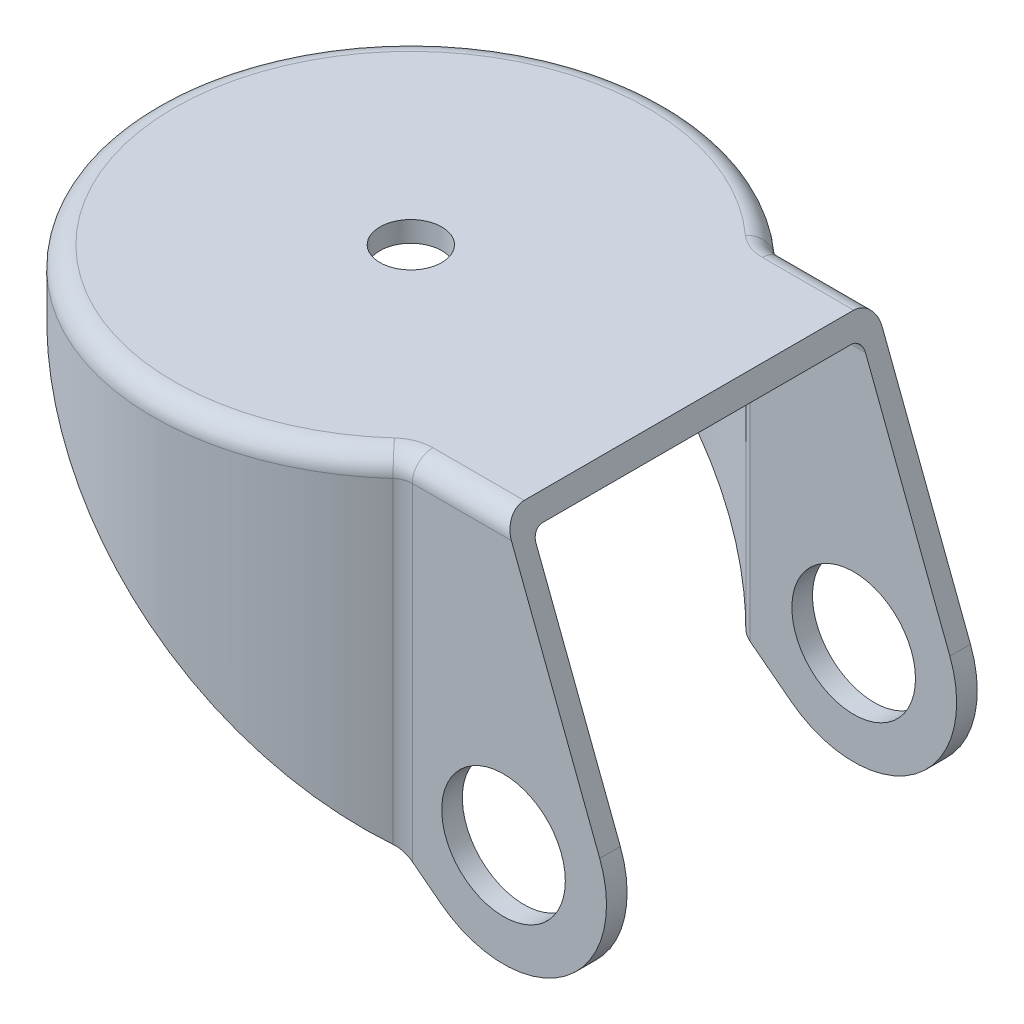
ISO-10303-21;
HEADER;
FILE_DESCRIPTION(('STEP AP214'),'2;1');
FILE_NAME('part.step','',(''),(''),'','','');
FILE_SCHEMA(('AUTOMOTIVE_DESIGN { 1 0 10303 214 1 1 1 1 }'));
ENDSEC;
DATA;
#1=APPLICATION_CONTEXT('core data for automotive mechanical design processes');
#2=APPLICATION_PROTOCOL_DEFINITION('international standard','automotive_design',2000,#1);
#3=PRODUCT_CONTEXT('',#1,'mechanical');
#4=PRODUCT('Part','Part','',(#3));
#5=PRODUCT_RELATED_PRODUCT_CATEGORY('part','',(#4));
#6=PRODUCT_DEFINITION_FORMATION('','',#4);
#7=PRODUCT_DEFINITION_CONTEXT('part definition',#1,'design');
#8=PRODUCT_DEFINITION('design','',#6,#7);
#9=PRODUCT_DEFINITION_SHAPE('','',#8);
#10=(LENGTH_UNIT() NAMED_UNIT(*) SI_UNIT(.MILLI.,.METRE.));
#11=(NAMED_UNIT(*) PLANE_ANGLE_UNIT() SI_UNIT($,.RADIAN.));
#12=(NAMED_UNIT(*) SI_UNIT($,.STERADIAN.) SOLID_ANGLE_UNIT());
#13=UNCERTAINTY_MEASURE_WITH_UNIT(LENGTH_MEASURE(1.E-05),#10,'distance_accuracy_value','');
#14=(GEOMETRIC_REPRESENTATION_CONTEXT(3) GLOBAL_UNCERTAINTY_ASSIGNED_CONTEXT((#13)) GLOBAL_UNIT_ASSIGNED_CONTEXT((#10,
#11,#12)) REPRESENTATION_CONTEXT('',''));
#15=CARTESIAN_POINT('',(0.,0.,0.));
#16=DIRECTION('',(0.,0.,1.));
#17=DIRECTION('',(1.,0.,0.));
#18=AXIS2_PLACEMENT_3D('',#15,#16,#17);
#19=CARTESIAN_POINT('',(-13.5,-7.,0.));
#20=DIRECTION('',(0.,1.,0.));
#21=DIRECTION('',(0.,0.,1.));
#22=AXIS2_PLACEMENT_3D('',#19,#20,#21);
#23=CYLINDRICAL_SURFACE('',#22,11.5);
#24=CARTESIAN_POINT('',(-13.5,4.05655226766467,0.));
#25=DIRECTION('',(-0.608761429008722,-0.793353340291234,0.));
#26=DIRECTION('',(-0.793353340291234,0.608761429008722,0.));
#27=AXIS2_PLACEMENT_3D('',#24,#25,#26);
#28=ELLIPSE('',#27,14.4954327611181,11.5);
#29=CARTESIAN_POINT('',(-5.38240187582832,-2.17229985057966,-8.14583333333333));
#30=VERTEX_POINT('',#29);
#31=CARTESIAN_POINT('',(-23.8521026326173,12.,-5.00839006904988));
#32=VERTEX_POINT('',#31);
#33=EDGE_CURVE('E205',#30,#32,#28,.F.);
#34=ORIENTED_EDGE('',*,*,#33,.F.);
#35=DIRECTION('',(0.,1.,0.));
#36=VECTOR('',#35,1.);
#37=CARTESIAN_POINT('',(-5.38240187582832,-7.,-8.14583333333333));
#38=LINE('',#37,#36);
#39=CARTESIAN_POINT('',(-5.38240187582832,12.5,-8.14583333333333));
#40=VERTEX_POINT('',#39);
#41=EDGE_CURVE('E332',#30,#40,#38,.T.);
#42=ORIENTED_EDGE('',*,*,#41,.T.);
#43=CARTESIAN_POINT('',(-13.5,12.5,0.));
#44=DIRECTION('',(0.,-1.,0.));
#45=DIRECTION('',(0.,0.,-1.));
#46=AXIS2_PLACEMENT_3D('',#43,#44,#45);
#47=CIRCLE('',#46,11.5);
#48=CARTESIAN_POINT('',(-5.38240187582831,12.5,8.14583333333333));
#49=VERTEX_POINT('',#48);
#50=EDGE_CURVE('E328',#40,#49,#47,.F.);
#51=ORIENTED_EDGE('',*,*,#50,.T.);
#52=DIRECTION('',(0.,1.,0.));
#53=VECTOR('',#52,1.);
#54=CARTESIAN_POINT('',(-5.38240187582831,-7.,8.14583333333333));
#55=LINE('',#54,#53);
#56=CARTESIAN_POINT('',(-5.38240187582831,-2.17229985057967,8.14583333333333));
#57=VERTEX_POINT('',#56);
#58=EDGE_CURVE('E330',#49,#57,#55,.F.);
#59=ORIENTED_EDGE('',*,*,#58,.T.);
#60=CARTESIAN_POINT('',(-23.8521026326173,12.,5.00839006904989));
#61=VERTEX_POINT('',#60);
#62=EDGE_CURVE('E195',#61,#57,#28,.F.);
#63=ORIENTED_EDGE('',*,*,#62,.F.);
#64=CARTESIAN_POINT('',(-13.5,12.,0.));
#65=DIRECTION('',(0.,-1.,0.));
#66=DIRECTION('',(1.,0.,0.));
#67=AXIS2_PLACEMENT_3D('',#64,#65,#66);
#68=CIRCLE('',#67,11.5);
#69=EDGE_CURVE('E204',#32,#61,#68,.F.);
#70=ORIENTED_EDGE('',*,*,#69,.F.);
#71=EDGE_LOOP('',(#34,#42,#51,#59,#63,#70));
#72=FACE_BOUND('',#71,.T.);
#73=ADVANCED_FACE('F32',(#72),#23,.F.);
#74=CARTESIAN_POINT('',(-3.04380714504358,-3.96676670145619,-9.));
#75=DIRECTION('',(0.608761429008717,0.793353340291238,0.));
#76=DIRECTION('',(-0.793353340291238,0.608761429008717,0.));
#77=AXIS2_PLACEMENT_3D('',#74,#75,#76);
#78=PLANE('',#77);
#79=DIRECTION('',(-0.793353340291238,0.608761429008717,0.));
#80=VECTOR('',#79,1.);
#81=CARTESIAN_POINT('',(-26.1699355153999,13.7785357245839,-8.));
#82=LINE('',#81,#80);
#83=CARTESIAN_POINT('',(-3.04380714504358,-3.96676670145619,-8.));
#84=VERTEX_POINT('',#83);
#85=CARTESIAN_POINT('',(-5.0294628269513,-2.44311950789465,-8.));
#86=VERTEX_POINT('',#85);
#87=EDGE_CURVE('E241',#84,#86,#82,.T.);
#88=ORIENTED_EDGE('',*,*,#87,.T.);
#89=CARTESIAN_POINT('',(-5.02946282695129,-2.44311950789466,-8.5));
#90=DIRECTION('',(0.608761429008717,0.793353340291238,0.));
#91=DIRECTION('',(-0.793353340291238,0.608761429008717,0.));
#92=AXIS2_PLACEMENT_3D('',#89,#90,#91);
#93=ELLIPSE('',#92,0.63023620700513,0.5);
#94=EDGE_CURVE('E326',#86,#30,#93,.F.);
#95=ORIENTED_EDGE('',*,*,#94,.T.);
#96=ORIENTED_EDGE('',*,*,#33,.T.);
#97=DIRECTION('',(0.,0.,-1.));
#98=VECTOR('',#97,1.);
#99=CARTESIAN_POINT('',(-23.8521026326173,12.,12.5));
#100=LINE('',#99,#98);
#101=CARTESIAN_POINT('',(-23.8521026326173,12.,-7.00599536709506));
#102=VERTEX_POINT('',#101);
#103=EDGE_CURVE('E206',#32,#102,#100,.T.);
#104=ORIENTED_EDGE('',*,*,#103,.T.);
#105=CARTESIAN_POINT('',(-13.5,4.05655226766466,0.));
#106=DIRECTION('',(-0.608761429008722,-0.793353340291234,0.));
#107=DIRECTION('',(-0.793353340291234,0.608761429008722,0.));
#108=AXIS2_PLACEMENT_3D('',#105,#106,#107);
#109=ELLIPSE('',#108,15.7559051751283,12.5);
#110=CARTESIAN_POINT('',(-5.10261243184395,-2.3869898419005,-9.25925925925926));
#111=VERTEX_POINT('',#110);
#112=EDGE_CURVE('E197',#102,#111,#109,.T.);
#113=ORIENTED_EDGE('',*,*,#112,.T.);
#114=CARTESIAN_POINT('',(-4.43082142639147,-2.90247321066573,-10.));
#115=DIRECTION('',(0.608761429008717,0.793353340291238,0.));
#116=DIRECTION('',(-0.793353340291238,0.608761429008717,0.));
#117=AXIS2_PLACEMENT_3D('',#114,#115,#116);
#118=ELLIPSE('',#117,1.26047241401026,1.);
#119=CARTESIAN_POINT('',(-4.43082142639147,-2.90247321066573,-9.));
#120=VERTEX_POINT('',#119);
#121=EDGE_CURVE('E299',#111,#120,#118,.T.);
#122=ORIENTED_EDGE('',*,*,#121,.T.);
#123=DIRECTION('',(-0.793353340291238,0.608761429008717,0.));
#124=VECTOR('',#123,1.);
#125=CARTESIAN_POINT('',(-3.04380714504358,-3.96676670145619,-9.));
#126=LINE('',#125,#124);
#127=CARTESIAN_POINT('',(-3.04380714504358,-3.96676670145619,-9.));
#128=VERTEX_POINT('',#127);
#129=EDGE_CURVE('E219',#128,#120,#126,.T.);
#130=ORIENTED_EDGE('',*,*,#129,.F.);
#131=DIRECTION('',(0.,0.,1.));
#132=VECTOR('',#131,1.);
#133=CARTESIAN_POINT('',(-3.04380714504358,-3.96676670145619,-9.));
#134=LINE('',#133,#132);
#135=EDGE_CURVE('E233',#128,#84,#134,.T.);
#136=ORIENTED_EDGE('',*,*,#135,.T.);
#137=EDGE_LOOP('',(#88,#95,#96,#104,#113,#122,#130,#136));
#138=FACE_BOUND('',#137,.T.);
#139=ADVANCED_FACE('F397',(#138),#78,.F.);
#140=ORIENTED_EDGE('',*,*,#62,.T.);
#141=CARTESIAN_POINT('',(-5.02946282695129,-2.44311950789466,8.49999999999999));
#142=DIRECTION('',(0.608761429008717,0.793353340291238,0.));
#143=DIRECTION('',(-0.793353340291238,0.608761429008717,0.));
#144=AXIS2_PLACEMENT_3D('',#141,#142,#143);
#145=ELLIPSE('',#144,0.63023620700513,0.5);
#146=CARTESIAN_POINT('',(-5.02946282695129,-2.44311950789466,8.));
#147=VERTEX_POINT('',#146);
#148=EDGE_CURVE('E338',#57,#147,#145,.F.);
#149=ORIENTED_EDGE('',*,*,#148,.T.);
#150=DIRECTION('',(0.793353340291238,-0.608761429008717,0.));
#151=VECTOR('',#150,1.);
#152=CARTESIAN_POINT('',(-16.9936401656538,6.73731665305799,8.));
#153=LINE('',#152,#151);
#154=CARTESIAN_POINT('',(-3.04380714504358,-3.96676670145619,7.99999999999999));
#155=VERTEX_POINT('',#154);
#156=EDGE_CURVE('E239',#147,#155,#153,.T.);
#157=ORIENTED_EDGE('',*,*,#156,.T.);
#158=CARTESIAN_POINT('',(-3.04380714504358,-3.96676670145619,9.));
#159=VERTEX_POINT('',#158);
#160=EDGE_CURVE('E224',#155,#159,#134,.T.);
#161=ORIENTED_EDGE('',*,*,#160,.T.);
#162=DIRECTION('',(-0.793353340291238,0.608761429008717,0.));
#163=VECTOR('',#162,1.);
#164=CARTESIAN_POINT('',(-3.04380714504358,-3.96676670145619,9.));
#165=LINE('',#164,#163);
#166=CARTESIAN_POINT('',(-4.43082142639146,-2.90247321066573,9.));
#167=VERTEX_POINT('',#166);
#168=EDGE_CURVE('E213',#159,#167,#165,.T.);
#169=ORIENTED_EDGE('',*,*,#168,.T.);
#170=CARTESIAN_POINT('',(-4.43082142639146,-2.90247321066574,9.99999999999999));
#171=DIRECTION('',(0.608761429008717,0.793353340291238,0.));
#172=DIRECTION('',(-0.793353340291238,0.608761429008717,0.));
#173=AXIS2_PLACEMENT_3D('',#170,#171,#172);
#174=ELLIPSE('',#173,1.26047241401026,1.);
#175=CARTESIAN_POINT('',(-5.10261243184394,-2.38698984190051,9.25925925925925));
#176=VERTEX_POINT('',#175);
#177=EDGE_CURVE('E190',#167,#176,#174,.T.);
#178=ORIENTED_EDGE('',*,*,#177,.T.);
#179=CARTESIAN_POINT('',(-23.8521026326173,12.,7.00599536709507));
#180=VERTEX_POINT('',#179);
#181=EDGE_CURVE('E182',#176,#180,#109,.T.);
#182=ORIENTED_EDGE('',*,*,#181,.T.);
#183=EDGE_CURVE('E186',#180,#61,#100,.T.);
#184=ORIENTED_EDGE('',*,*,#183,.T.);
#185=EDGE_LOOP('',(#140,#149,#157,#161,#169,#178,#182,#184));
#186=FACE_BOUND('',#185,.T.);
#187=ADVANCED_FACE('F185',(#186),#78,.F.);
#188=CARTESIAN_POINT('',(-13.5,-5.,0.));
#189=DIRECTION('',(0.,1.,0.));
#190=DIRECTION('',(0.,0.,1.));
#191=AXIS2_PLACEMENT_3D('',#188,#189,#190);
#192=CYLINDRICAL_SURFACE('',#191,12.5);
#193=CARTESIAN_POINT('',(-13.5,13.,0.));
#194=DIRECTION('',(0.,-1.,0.));
#195=DIRECTION('',(0.,0.,-1.));
#196=AXIS2_PLACEMENT_3D('',#193,#194,#195);
#197=CIRCLE('',#196,12.5);
#198=CARTESIAN_POINT('',(-5.10261243184394,13.,9.25925925925926));
#199=VERTEX_POINT('',#198);
#200=CARTESIAN_POINT('',(-5.10261243184395,13.,-9.25925925925925));
#201=VERTEX_POINT('',#200);
#202=EDGE_CURVE('E295',#199,#201,#197,.T.);
#203=ORIENTED_EDGE('',*,*,#202,.T.);
#204=DIRECTION('',(0.,1.,0.));
#205=VECTOR('',#204,1.);
#206=CARTESIAN_POINT('',(-5.10261243184395,-5.,-9.25925925925926));
#207=LINE('',#206,#205);
#208=EDGE_CURVE('E297',#201,#111,#207,.F.);
#209=ORIENTED_EDGE('',*,*,#208,.T.);
#210=ORIENTED_EDGE('',*,*,#112,.F.);
#211=CARTESIAN_POINT('',(-13.5,12.,0.));
#212=DIRECTION('',(0.,-1.,0.));
#213=DIRECTION('',(1.,0.,0.));
#214=AXIS2_PLACEMENT_3D('',#211,#212,#213);
#215=CIRCLE('',#214,12.5);
#216=EDGE_CURVE('E194',#180,#102,#215,.T.);
#217=ORIENTED_EDGE('',*,*,#216,.F.);
#218=ORIENTED_EDGE('',*,*,#181,.F.);
#219=DIRECTION('',(0.,1.,0.));
#220=VECTOR('',#219,1.);
#221=CARTESIAN_POINT('',(-5.10261243184394,-5.,9.25925925925925));
#222=LINE('',#221,#220);
#223=EDGE_CURVE('E293',#176,#199,#222,.T.);
#224=ORIENTED_EDGE('',*,*,#223,.T.);
#225=EDGE_LOOP('',(#203,#209,#210,#217,#218,#224));
#226=FACE_BOUND('',#225,.T.);
#227=ADVANCED_FACE('F208',(#226),#192,.T.);
#228=CARTESIAN_POINT('',(-26.,13.,9.));
#229=DIRECTION('',(0.,-1.,0.));
#230=DIRECTION('',(0.,0.,-1.));
#231=AXIS2_PLACEMENT_3D('',#228,#229,#230);
#232=PLANE('',#231);
#233=DIRECTION('',(0.,0.,-1.));
#234=VECTOR('',#233,1.);
#235=CARTESIAN_POINT('',(0.382359556450936,13.,9.));
#236=LINE('',#235,#234);
#237=CARTESIAN_POINT('',(0.382359556450936,13.,7.5));
#238=VERTEX_POINT('',#237);
#239=CARTESIAN_POINT('',(0.382359556450936,13.,-7.5));
#240=VERTEX_POINT('',#239);
#241=EDGE_CURVE('E250',#238,#240,#236,.T.);
#242=ORIENTED_EDGE('',*,*,#241,.F.);
#243=DIRECTION('',(1.,0.,0.));
#244=VECTOR('',#243,1.);
#245=CARTESIAN_POINT('',(-5.23864417907084,13.,7.5));
#246=LINE('',#245,#244);
#247=CARTESIAN_POINT('',(-5.02946282695129,13.,7.5));
#248=VERTEX_POINT('',#247);
#249=EDGE_CURVE('E49',#238,#248,#246,.F.);
#250=ORIENTED_EDGE('',*,*,#249,.T.);
#251=CARTESIAN_POINT('',(-5.02946282695129,13.,8.49999999999999));
#252=DIRECTION('',(0.,-1.,0.));
#253=DIRECTION('',(0.,0.,-1.));
#254=AXIS2_PLACEMENT_3D('',#251,#252,#253);
#255=CIRCLE('',#254,1.);
#256=CARTESIAN_POINT('',(-5.73534092470534,13.,7.79166666666666));
#257=VERTEX_POINT('',#256);
#258=EDGE_CURVE('E54',#257,#248,#255,.T.);
#259=ORIENTED_EDGE('',*,*,#258,.F.);
#260=CARTESIAN_POINT('',(-13.5,13.,0.));
#261=DIRECTION('',(0.,-1.,0.));
#262=DIRECTION('',(0.,0.,-1.));
#263=AXIS2_PLACEMENT_3D('',#260,#261,#262);
#264=CIRCLE('',#263,11.);
#265=CARTESIAN_POINT('',(-5.73534092470535,13.,-7.79166666666666));
#266=VERTEX_POINT('',#265);
#267=EDGE_CURVE('E343',#257,#266,#264,.T.);
#268=ORIENTED_EDGE('',*,*,#267,.T.);
#269=CARTESIAN_POINT('',(-5.02946282695129,13.,-8.49999999999999));
#270=DIRECTION('',(0.,-1.,0.));
#271=DIRECTION('',(0.,0.,-1.));
#272=AXIS2_PLACEMENT_3D('',#269,#270,#271);
#273=CIRCLE('',#272,1.);
#274=CARTESIAN_POINT('',(-5.02946282695129,13.,-7.5));
#275=VERTEX_POINT('',#274);
#276=EDGE_CURVE('E340',#275,#266,#273,.T.);
#277=ORIENTED_EDGE('',*,*,#276,.F.);
#278=DIRECTION('',(1.,0.,0.));
#279=VECTOR('',#278,1.);
#280=CARTESIAN_POINT('',(0.382359556450936,13.,-7.5));
#281=LINE('',#280,#279);
#282=EDGE_CURVE('E345',#275,#240,#281,.T.);
#283=ORIENTED_EDGE('',*,*,#282,.T.);
#284=EDGE_LOOP('',(#242,#250,#259,#268,#277,#283));
#285=FACE_BOUND('',#284,.T.);
#286=CARTESIAN_POINT('',(-13.5,13.,0.));
#287=DIRECTION('',(0.,-1.,0.));
#288=DIRECTION('',(0.,0.,-1.));
#289=AXIS2_PLACEMENT_3D('',#286,#287,#288);
#290=CIRCLE('',#289,1.5);
#291=CARTESIAN_POINT('',(-13.5,13.,-1.5));
#292=VERTEX_POINT('',#291);
#293=EDGE_CURVE('E429',#292,#292,#290,.T.);
#294=ORIENTED_EDGE('',*,*,#293,.F.);
#295=EDGE_LOOP('',(#294));
#296=FACE_BOUND('',#295,.T.);
#297=ADVANCED_FACE('F375',(#285,#296),#232,.T.);
#298=CARTESIAN_POINT('',(-26.,14.,-8.));
#299=DIRECTION('',(0.,0.,1.));
#300=DIRECTION('',(1.,0.,0.));
#301=AXIS2_PLACEMENT_3D('',#298,#299,#300);
#302=PLANE('',#301);
#303=DIRECTION('',(1.,0.,0.));
#304=VECTOR('',#303,1.);
#305=CARTESIAN_POINT('',(-5.23864417907086,12.5,-8.));
#306=LINE('',#305,#304);
#307=CARTESIAN_POINT('',(0.573539334676399,12.5,-8.));
#308=VERTEX_POINT('',#307);
#309=CARTESIAN_POINT('',(-5.02946282695129,12.5,-8.));
#310=VERTEX_POINT('',#309);
#311=EDGE_CURVE('E302',#308,#310,#306,.F.);
#312=ORIENTED_EDGE('',*,*,#311,.T.);
#313=DIRECTION('',(0.,-1.,0.));
#314=VECTOR('',#313,1.);
#315=CARTESIAN_POINT('',(-5.02946282695129,-2.28260901103138,-8.));
#316=LINE('',#315,#314);
#317=EDGE_CURVE('E323',#310,#86,#316,.T.);
#318=ORIENTED_EDGE('',*,*,#317,.T.);
#319=ORIENTED_EDGE('',*,*,#87,.F.);
#320=CARTESIAN_POINT('',(0.,0.,-8.));
#321=DIRECTION('',(0.,0.,1.));
#322=DIRECTION('',(1.,0.,0.));
#323=AXIS2_PLACEMENT_3D('',#320,#321,#322);
#324=CIRCLE('',#323,5.);
#325=CARTESIAN_POINT('',(4.67024886807929,1.78571428571429,-8.));
#326=VERTEX_POINT('',#325);
#327=EDGE_CURVE('E231',#326,#84,#324,.F.);
#328=ORIENTED_EDGE('',*,*,#327,.F.);
#329=DIRECTION('',(0.357142857142857,-0.934049773615859,0.));
#330=VECTOR('',#329,1.);
#331=CARTESIAN_POINT('',(-3.31632653061225,22.673319326433,-8.));
#332=LINE('',#331,#330);
#333=EDGE_CURVE('E253',#308,#326,#332,.T.);
#334=ORIENTED_EDGE('',*,*,#333,.F.);
#335=EDGE_LOOP('',(#312,#318,#319,#328,#334));
#336=FACE_BOUND('',#335,.T.);
#337=CARTESIAN_POINT('',(0.,0.,-8.));
#338=DIRECTION('',(0.,0.,1.));
#339=DIRECTION('',(1.,0.,0.));
#340=AXIS2_PLACEMENT_3D('',#337,#338,#339);
#341=CIRCLE('',#340,3.);
#342=CARTESIAN_POINT('',(3.,0.,-8.));
#343=VERTEX_POINT('',#342);
#344=EDGE_CURVE('E264',#343,#343,#341,.T.);
#345=ORIENTED_EDGE('',*,*,#344,.F.);
#346=EDGE_LOOP('',(#345));
#347=FACE_BOUND('',#346,.T.);
#348=ADVANCED_FACE('F392',(#336,#347),#302,.T.);
#349=CARTESIAN_POINT('',(-26.,-5.,8.));
#350=DIRECTION('',(0.,0.,-1.));
#351=DIRECTION('',(0.,1.,0.));
#352=AXIS2_PLACEMENT_3D('',#349,#350,#351);
#353=PLANE('',#352);
#354=ORIENTED_EDGE('',*,*,#156,.F.);
#355=DIRECTION('',(0.,-1.,0.));
#356=VECTOR('',#355,1.);
#357=CARTESIAN_POINT('',(-5.02946282695129,13.,8.));
#358=LINE('',#357,#356);
#359=CARTESIAN_POINT('',(-5.02946282695129,12.5,8.));
#360=VERTEX_POINT('',#359);
#361=EDGE_CURVE('E336',#147,#360,#358,.F.);
#362=ORIENTED_EDGE('',*,*,#361,.T.);
#363=DIRECTION('',(1.,0.,0.));
#364=VECTOR('',#363,1.);
#365=CARTESIAN_POINT('',(0.382359556450936,12.5,8.));
#366=LINE('',#365,#364);
#367=CARTESIAN_POINT('',(0.573539334676403,12.5,8.));
#368=VERTEX_POINT('',#367);
#369=EDGE_CURVE('E334',#360,#368,#366,.T.);
#370=ORIENTED_EDGE('',*,*,#369,.T.);
#371=DIRECTION('',(-0.357142857142857,0.934049773615859,0.));
#372=VECTOR('',#371,1.);
#373=CARTESIAN_POINT('',(3.02186836178108,6.09678871418807,8.));
#374=LINE('',#373,#372);
#375=CARTESIAN_POINT('',(4.67024886807929,1.78571428571429,8.));
#376=VERTEX_POINT('',#375);
#377=EDGE_CURVE('E247',#376,#368,#374,.T.);
#378=ORIENTED_EDGE('',*,*,#377,.F.);
#379=CARTESIAN_POINT('',(0.,0.,7.99999999999999));
#380=DIRECTION('',(0.,0.,-1.));
#381=DIRECTION('',(0.,1.,0.));
#382=AXIS2_PLACEMENT_3D('',#379,#380,#381);
#383=CIRCLE('',#382,5.);
#384=EDGE_CURVE('E237',#155,#376,#383,.F.);
#385=ORIENTED_EDGE('',*,*,#384,.F.);
#386=EDGE_LOOP('',(#354,#362,#370,#378,#385));
#387=FACE_BOUND('',#386,.T.);
#388=CARTESIAN_POINT('',(0.,0.,7.99999999999999));
#389=DIRECTION('',(0.,0.,-1.));
#390=DIRECTION('',(0.,1.,0.));
#391=AXIS2_PLACEMENT_3D('',#388,#389,#390);
#392=CIRCLE('',#391,3.);
#393=CARTESIAN_POINT('',(0.,3.,7.99999999999999));
#394=VERTEX_POINT('',#393);
#395=EDGE_CURVE('E259',#394,#394,#392,.T.);
#396=ORIENTED_EDGE('',*,*,#395,.F.);
#397=EDGE_LOOP('',(#396));
#398=FACE_BOUND('',#397,.T.);
#399=ADVANCED_FACE('F416',(#387,#398),#353,.T.);
#400=CARTESIAN_POINT('',(-26.,-5.,9.));
#401=DIRECTION('',(0.,0.,-1.));
#402=DIRECTION('',(0.,1.,0.));
#403=AXIS2_PLACEMENT_3D('',#400,#401,#402);
#404=PLANE('',#403);
#405=CARTESIAN_POINT('',(0.,0.,9.));
#406=DIRECTION('',(0.,0.,1.));
#407=DIRECTION('',(1.,0.,0.));
#408=AXIS2_PLACEMENT_3D('',#405,#406,#407);
#409=CIRCLE('',#408,3.);
#410=CARTESIAN_POINT('',(3.,0.,9.));
#411=VERTEX_POINT('',#410);
#412=EDGE_CURVE('E255',#411,#411,#409,.T.);
#413=ORIENTED_EDGE('',*,*,#412,.F.);
#414=EDGE_LOOP('',(#413));
#415=FACE_BOUND('',#414,.T.);
#416=DIRECTION('',(0.357142857142857,-0.934049773615859,0.));
#417=VECTOR('',#416,1.);
#418=CARTESIAN_POINT('',(4.67024886807929,1.78571428571429,9.));
#419=LINE('',#418,#417);
#420=CARTESIAN_POINT('',(0.382359556450936,13.,9.));
#421=VERTEX_POINT('',#420);
#422=CARTESIAN_POINT('',(4.67024886807929,1.78571428571429,9.));
#423=VERTEX_POINT('',#422);
#424=EDGE_CURVE('E220',#421,#423,#419,.T.);
#425=ORIENTED_EDGE('',*,*,#424,.F.);
#426=DIRECTION('',(1.,0.,0.));
#427=VECTOR('',#426,1.);
#428=CARTESIAN_POINT('',(-26.,13.,9.));
#429=LINE('',#428,#427);
#430=CARTESIAN_POINT('',(-4.43082142639146,13.,9.));
#431=VERTEX_POINT('',#430);
#432=EDGE_CURVE('E287',#421,#431,#429,.F.);
#433=ORIENTED_EDGE('',*,*,#432,.T.);
#434=DIRECTION('',(0.,-1.,0.));
#435=VECTOR('',#434,1.);
#436=CARTESIAN_POINT('',(-4.43082142639146,-2.59976057524508,9.));
#437=LINE('',#436,#435);
#438=EDGE_CURVE('E285',#431,#167,#437,.T.);
#439=ORIENTED_EDGE('',*,*,#438,.T.);
#440=ORIENTED_EDGE('',*,*,#168,.F.);
#441=CARTESIAN_POINT('',(0.,0.,9.));
#442=DIRECTION('',(0.,0.,-1.));
#443=DIRECTION('',(1.,0.,0.));
#444=AXIS2_PLACEMENT_3D('',#441,#442,#443);
#445=CIRCLE('',#444,5.);
#446=EDGE_CURVE('E210',#423,#159,#445,.T.);
#447=ORIENTED_EDGE('',*,*,#446,.F.);
#448=EDGE_LOOP('',(#425,#433,#439,#440,#447));
#449=FACE_BOUND('',#448,.T.);
#450=ADVANCED_FACE('F454',(#415,#449),#404,.F.);
#451=CARTESIAN_POINT('',(-26.,14.,-9.));
#452=DIRECTION('',(0.,0.,1.));
#453=DIRECTION('',(1.,0.,0.));
#454=AXIS2_PLACEMENT_3D('',#451,#452,#453);
#455=PLANE('',#454);
#456=CARTESIAN_POINT('',(0.,0.,-9.));
#457=DIRECTION('',(0.,0.,1.));
#458=DIRECTION('',(1.,0.,0.));
#459=AXIS2_PLACEMENT_3D('',#456,#457,#458);
#460=CIRCLE('',#459,3.);
#461=CARTESIAN_POINT('',(3.,0.,-9.));
#462=VERTEX_POINT('',#461);
#463=EDGE_CURVE('E256',#462,#462,#460,.T.);
#464=ORIENTED_EDGE('',*,*,#463,.T.);
#465=EDGE_LOOP('',(#464));
#466=FACE_BOUND('',#465,.T.);
#467=DIRECTION('',(0.,-1.,0.));
#468=VECTOR('',#467,1.);
#469=CARTESIAN_POINT('',(-4.43082142639147,14.,-9.));
#470=LINE('',#469,#468);
#471=CARTESIAN_POINT('',(-4.43082142639147,13.,-9.));
#472=VERTEX_POINT('',#471);
#473=EDGE_CURVE('E289',#120,#472,#470,.F.);
#474=ORIENTED_EDGE('',*,*,#473,.T.);
#475=DIRECTION('',(1.,0.,0.));
#476=VECTOR('',#475,1.);
#477=CARTESIAN_POINT('',(-26.,13.,-9.));
#478=LINE('',#477,#476);
#479=CARTESIAN_POINT('',(0.382359556450935,13.,-9.));
#480=VERTEX_POINT('',#479);
#481=EDGE_CURVE('E291',#472,#480,#478,.T.);
#482=ORIENTED_EDGE('',*,*,#481,.T.);
#483=DIRECTION('',(0.357142857142857,-0.934049773615859,0.));
#484=VECTOR('',#483,1.);
#485=CARTESIAN_POINT('',(4.67024886807929,1.78571428571429,-9.));
#486=LINE('',#485,#484);
#487=CARTESIAN_POINT('',(4.67024886807929,1.78571428571429,-9.));
#488=VERTEX_POINT('',#487);
#489=EDGE_CURVE('E223',#480,#488,#486,.T.);
#490=ORIENTED_EDGE('',*,*,#489,.T.);
#491=CARTESIAN_POINT('',(0.,0.,-9.));
#492=DIRECTION('',(0.,0.,-1.));
#493=DIRECTION('',(1.,0.,0.));
#494=AXIS2_PLACEMENT_3D('',#491,#492,#493);
#495=CIRCLE('',#494,5.);
#496=EDGE_CURVE('E217',#488,#128,#495,.T.);
#497=ORIENTED_EDGE('',*,*,#496,.T.);
#498=ORIENTED_EDGE('',*,*,#129,.T.);
#499=EDGE_LOOP('',(#474,#482,#490,#497,#498));
#500=FACE_BOUND('',#499,.T.);
#501=ADVANCED_FACE('F457',(#466,#500),#455,.F.);
#502=CARTESIAN_POINT('',(-26.,14.,9.));
#503=DIRECTION('',(0.,-1.,0.));
#504=DIRECTION('',(0.,0.,-1.));
#505=AXIS2_PLACEMENT_3D('',#502,#503,#504);
#506=PLANE('',#505);
#507=CARTESIAN_POINT('',(-13.5,14.,0.));
#508=DIRECTION('',(0.,1.,0.));
#509=DIRECTION('',(0.,0.,1.));
#510=AXIS2_PLACEMENT_3D('',#507,#508,#509);
#511=CIRCLE('',#510,1.5);
#512=CARTESIAN_POINT('',(-13.5,14.,1.5));
#513=VERTEX_POINT('',#512);
#514=EDGE_CURVE('E321',#513,#513,#511,.T.);
#515=ORIENTED_EDGE('',*,*,#514,.F.);
#516=EDGE_LOOP('',(#515));
#517=FACE_BOUND('',#516,.T.);
#518=CARTESIAN_POINT('',(-4.43082142639146,14.,9.99999999999999));
#519=DIRECTION('',(0.,-1.,0.));
#520=DIRECTION('',(0.,0.,-1.));
#521=AXIS2_PLACEMENT_3D('',#518,#519,#520);
#522=CIRCLE('',#521,2.);
#523=CARTESIAN_POINT('',(-4.43082142639146,14.,8.));
#524=VERTEX_POINT('',#523);
#525=CARTESIAN_POINT('',(-5.77440343729643,14.,8.51851851851851));
#526=VERTEX_POINT('',#525);
#527=EDGE_CURVE('E268',#524,#526,#522,.F.);
#528=ORIENTED_EDGE('',*,*,#527,.F.);
#529=DIRECTION('',(1.,0.,0.));
#530=VECTOR('',#529,1.);
#531=CARTESIAN_POINT('',(-26.,14.,8.));
#532=LINE('',#531,#530);
#533=CARTESIAN_POINT('',(0.,14.,8.));
#534=VERTEX_POINT('',#533);
#535=EDGE_CURVE('E278',#524,#534,#532,.T.);
#536=ORIENTED_EDGE('',*,*,#535,.T.);
#537=DIRECTION('',(0.,0.,-1.));
#538=VECTOR('',#537,1.);
#539=CARTESIAN_POINT('',(0.,14.,9.));
#540=LINE('',#539,#538);
#541=CARTESIAN_POINT('',(0.,14.,-8.));
#542=VERTEX_POINT('',#541);
#543=EDGE_CURVE('E244',#534,#542,#540,.T.);
#544=ORIENTED_EDGE('',*,*,#543,.T.);
#545=DIRECTION('',(1.,0.,0.));
#546=VECTOR('',#545,1.);
#547=CARTESIAN_POINT('',(-26.,14.,-8.));
#548=LINE('',#547,#546);
#549=CARTESIAN_POINT('',(-4.43082142639147,14.,-8.));
#550=VERTEX_POINT('',#549);
#551=EDGE_CURVE('E276',#542,#550,#548,.F.);
#552=ORIENTED_EDGE('',*,*,#551,.T.);
#553=CARTESIAN_POINT('',(-4.43082142639147,14.,-9.99999999999999));
#554=DIRECTION('',(0.,-1.,0.));
#555=DIRECTION('',(0.,0.,-1.));
#556=AXIS2_PLACEMENT_3D('',#553,#554,#555);
#557=CIRCLE('',#556,2.);
#558=CARTESIAN_POINT('',(-5.77440343729644,14.,-8.51851851851851));
#559=VERTEX_POINT('',#558);
#560=EDGE_CURVE('E273',#559,#550,#557,.F.);
#561=ORIENTED_EDGE('',*,*,#560,.F.);
#562=CARTESIAN_POINT('',(-13.5,14.,0.));
#563=DIRECTION('',(0.,-1.,0.));
#564=DIRECTION('',(0.,0.,-1.));
#565=AXIS2_PLACEMENT_3D('',#562,#563,#564);
#566=CIRCLE('',#565,11.5);
#567=EDGE_CURVE('E271',#559,#526,#566,.F.);
#568=ORIENTED_EDGE('',*,*,#567,.T.);
#569=EDGE_LOOP('',(#528,#536,#544,#552,#561,#568));
#570=FACE_BOUND('',#569,.T.);
#571=ADVANCED_FACE('F459',(#517,#570),#506,.F.);
#572=CARTESIAN_POINT('',(0.,0.,-9.));
#573=DIRECTION('',(0.,0.,1.));
#574=DIRECTION('',(1.,0.,0.));
#575=AXIS2_PLACEMENT_3D('',#572,#573,#574);
#576=CYLINDRICAL_SURFACE('',#575,3.);
#577=ORIENTED_EDGE('',*,*,#344,.T.);
#578=EDGE_LOOP('',(#577));
#579=FACE_BOUND('',#578,.T.);
#580=ORIENTED_EDGE('',*,*,#463,.F.);
#581=EDGE_LOOP('',(#580));
#582=FACE_BOUND('',#581,.T.);
#583=ADVANCED_FACE('F448',(#579,#582),#576,.F.);
#584=ORIENTED_EDGE('',*,*,#395,.T.);
#585=EDGE_LOOP('',(#584));
#586=FACE_BOUND('',#585,.T.);
#587=ORIENTED_EDGE('',*,*,#412,.T.);
#588=EDGE_LOOP('',(#587));
#589=FACE_BOUND('',#588,.T.);
#590=ADVANCED_FACE('F442',(#586,#589),#576,.F.);
#591=CARTESIAN_POINT('',(4.67024886807929,1.78571428571429,-9.));
#592=DIRECTION('',(-0.934049773615859,-0.357142857142857,0.));
#593=DIRECTION('',(0.357142857142857,-0.934049773615859,0.));
#594=AXIS2_PLACEMENT_3D('',#591,#592,#593);
#595=PLANE('',#594);
#596=ORIENTED_EDGE('',*,*,#543,.F.);
#597=CARTESIAN_POINT('',(0.382359556450936,13.,8.));
#598=DIRECTION('',(-0.934049773615859,-0.357142857142857,0.));
#599=DIRECTION('',(0.357142857142857,-0.934049773615859,0.));
#600=AXIS2_PLACEMENT_3D('',#597,#598,#599);
#601=ELLIPSE('',#600,1.07060675806262,1.);
#602=EDGE_CURVE('E283',#534,#421,#601,.F.);
#603=ORIENTED_EDGE('',*,*,#602,.T.);
#604=ORIENTED_EDGE('',*,*,#424,.T.);
#605=DIRECTION('',(0.,0.,1.));
#606=VECTOR('',#605,1.);
#607=CARTESIAN_POINT('',(4.67024886807929,1.78571428571429,-9.));
#608=LINE('',#607,#606);
#609=EDGE_CURVE('E232',#376,#423,#608,.T.);
#610=ORIENTED_EDGE('',*,*,#609,.F.);
#611=ORIENTED_EDGE('',*,*,#377,.T.);
#612=CARTESIAN_POINT('',(0.573539334676406,12.5,7.5));
#613=DIRECTION('',(-0.934049773615859,-0.357142857142857,0.));
#614=DIRECTION('',(-0.357142857142857,0.934049773615859,0.));
#615=AXIS2_PLACEMENT_3D('',#612,#613,#614);
#616=ELLIPSE('',#615,0.535303379031311,0.5);
#617=EDGE_CURVE('E41',#368,#238,#616,.T.);
#618=ORIENTED_EDGE('',*,*,#617,.T.);
#619=ORIENTED_EDGE('',*,*,#241,.T.);
#620=CARTESIAN_POINT('',(0.573539334676403,12.5,-7.5));
#621=DIRECTION('',(-0.934049773615859,-0.357142857142857,0.));
#622=DIRECTION('',(-0.357142857142857,0.934049773615859,0.));
#623=AXIS2_PLACEMENT_3D('',#620,#621,#622);
#624=ELLIPSE('',#623,0.535303379031311,0.5);
#625=EDGE_CURVE('E11',#240,#308,#624,.T.);
#626=ORIENTED_EDGE('',*,*,#625,.T.);
#627=ORIENTED_EDGE('',*,*,#333,.T.);
#628=EDGE_CURVE('E228',#488,#326,#608,.T.);
#629=ORIENTED_EDGE('',*,*,#628,.F.);
#630=ORIENTED_EDGE('',*,*,#489,.F.);
#631=CARTESIAN_POINT('',(0.382359556450936,13.,-8.));
#632=DIRECTION('',(-0.934049773615859,-0.357142857142857,0.));
#633=DIRECTION('',(0.357142857142857,-0.934049773615859,0.));
#634=AXIS2_PLACEMENT_3D('',#631,#632,#633);
#635=ELLIPSE('',#634,1.07060675806262,1.);
#636=EDGE_CURVE('E281',#480,#542,#635,.F.);
#637=ORIENTED_EDGE('',*,*,#636,.T.);
#638=EDGE_LOOP('',(#596,#603,#604,#610,#611,#618,#619,#626,#627,#629,#630,#637));
#639=FACE_BOUND('',#638,.T.);
#640=ADVANCED_FACE('F407',(#639),#595,.F.);
#641=CARTESIAN_POINT('',(0.,0.,-9.));
#642=DIRECTION('',(0.,0.,1.));
#643=DIRECTION('',(1.,0.,0.));
#644=AXIS2_PLACEMENT_3D('',#641,#642,#643);
#645=CYLINDRICAL_SURFACE('',#644,5.);
#646=ORIENTED_EDGE('',*,*,#327,.T.);
#647=ORIENTED_EDGE('',*,*,#135,.F.);
#648=ORIENTED_EDGE('',*,*,#496,.F.);
#649=ORIENTED_EDGE('',*,*,#628,.T.);
#650=EDGE_LOOP('',(#646,#647,#648,#649));
#651=FACE_BOUND('',#650,.T.);
#652=ADVANCED_FACE('F403',(#651),#645,.T.);
#653=ORIENTED_EDGE('',*,*,#384,.T.);
#654=ORIENTED_EDGE('',*,*,#609,.T.);
#655=ORIENTED_EDGE('',*,*,#446,.T.);
#656=ORIENTED_EDGE('',*,*,#160,.F.);
#657=EDGE_LOOP('',(#653,#654,#655,#656));
#658=FACE_BOUND('',#657,.T.);
#659=ADVANCED_FACE('F424',(#658),#645,.T.);
#660=CARTESIAN_POINT('',(-23.8521026326173,12.,12.5));
#661=DIRECTION('',(0.,-1.,0.));
#662=DIRECTION('',(1.,0.,0.));
#663=AXIS2_PLACEMENT_3D('',#660,#661,#662);
#664=PLANE('',#663);
#665=ORIENTED_EDGE('',*,*,#216,.T.);
#666=ORIENTED_EDGE('',*,*,#103,.F.);
#667=ORIENTED_EDGE('',*,*,#69,.T.);
#668=ORIENTED_EDGE('',*,*,#183,.F.);
#669=EDGE_LOOP('',(#665,#666,#667,#668));
#670=FACE_BOUND('',#669,.T.);
#671=ADVANCED_FACE('F200',(#670),#664,.T.);
#672=CARTESIAN_POINT('',(-13.5,-5.,0.));
#673=DIRECTION('',(0.,1.,0.));
#674=DIRECTION('',(0.,0.,1.));
#675=AXIS2_PLACEMENT_3D('',#672,#673,#674);
#676=CYLINDRICAL_SURFACE('',#675,1.5);
#677=ORIENTED_EDGE('',*,*,#293,.T.);
#678=EDGE_LOOP('',(#677));
#679=FACE_BOUND('',#678,.T.);
#680=ORIENTED_EDGE('',*,*,#514,.T.);
#681=EDGE_LOOP('',(#680));
#682=FACE_BOUND('',#681,.T.);
#683=ADVANCED_FACE('F495',(#679,#682),#676,.F.);
#684=CARTESIAN_POINT('',(-4.43082142639147,-5.,-10.));
#685=DIRECTION('',(0.,1.,0.));
#686=DIRECTION('',(0.,0.,1.));
#687=AXIS2_PLACEMENT_3D('',#684,#685,#686);
#688=CYLINDRICAL_SURFACE('',#687,1.);
#689=ORIENTED_EDGE('',*,*,#121,.F.);
#690=ORIENTED_EDGE('',*,*,#208,.F.);
#691=CARTESIAN_POINT('',(-4.43082142639147,13.,-9.99999999999999));
#692=DIRECTION('',(0.,-1.,0.));
#693=DIRECTION('',(0.,0.,-1.));
#694=AXIS2_PLACEMENT_3D('',#691,#692,#693);
#695=CIRCLE('',#694,1.);
#696=EDGE_CURVE('E318',#472,#201,#695,.T.);
#697=ORIENTED_EDGE('',*,*,#696,.F.);
#698=ORIENTED_EDGE('',*,*,#473,.F.);
#699=EDGE_LOOP('',(#689,#690,#697,#698));
#700=FACE_BOUND('',#699,.T.);
#701=ADVANCED_FACE('F491',(#700),#688,.F.);
#702=CARTESIAN_POINT('',(-26.,13.,-8.));
#703=DIRECTION('',(1.,0.,0.));
#704=DIRECTION('',(0.,0.,-1.));
#705=AXIS2_PLACEMENT_3D('',#702,#703,#704);
#706=CYLINDRICAL_SURFACE('',#705,1.);
#707=ORIENTED_EDGE('',*,*,#636,.F.);
#708=ORIENTED_EDGE('',*,*,#481,.F.);
#709=CARTESIAN_POINT('',(-4.43082142639147,13.,-8.));
#710=DIRECTION('',(-1.,0.,0.));
#711=DIRECTION('',(0.,0.,1.));
#712=AXIS2_PLACEMENT_3D('',#709,#710,#711);
#713=CIRCLE('',#712,1.);
#714=EDGE_CURVE('E315',#550,#472,#713,.T.);
#715=ORIENTED_EDGE('',*,*,#714,.F.);
#716=ORIENTED_EDGE('',*,*,#551,.F.);
#717=EDGE_LOOP('',(#707,#708,#715,#716));
#718=FACE_BOUND('',#717,.T.);
#719=ADVANCED_FACE('F487',(#718),#706,.T.);
#720=CARTESIAN_POINT('',(-4.43082142639147,13.,-9.99999999999999));
#721=DIRECTION('',(0.,-1.,0.));
#722=DIRECTION('',(0.,0.,-1.));
#723=AXIS2_PLACEMENT_3D('',#720,#721,#722);
#724=TOROIDAL_SURFACE('',#723,2.,1.);
#725=ORIENTED_EDGE('',*,*,#714,.T.);
#726=ORIENTED_EDGE('',*,*,#696,.T.);
#727=CARTESIAN_POINT('',(-5.77440343729644,13.,-8.51851851851851));
#728=DIRECTION('',(0.740740740740741,0.,0.671791005452483));
#729=DIRECTION('',(0.671791005452483,0.,-0.740740740740741));
#730=AXIS2_PLACEMENT_3D('',#727,#728,#729);
#731=CIRCLE('',#730,1.);
#732=EDGE_CURVE('E312',#559,#201,#731,.F.);
#733=ORIENTED_EDGE('',*,*,#732,.F.);
#734=ORIENTED_EDGE('',*,*,#560,.T.);
#735=EDGE_LOOP('',(#725,#726,#733,#734));
#736=FACE_BOUND('',#735,.T.);
#737=ADVANCED_FACE('F483',(#736),#724,.T.);
#738=CARTESIAN_POINT('',(-4.43082142639146,-5.,9.99999999999999));
#739=DIRECTION('',(0.,1.,0.));
#740=DIRECTION('',(0.,0.,1.));
#741=AXIS2_PLACEMENT_3D('',#738,#739,#740);
#742=CYLINDRICAL_SURFACE('',#741,1.);
#743=ORIENTED_EDGE('',*,*,#177,.F.);
#744=ORIENTED_EDGE('',*,*,#438,.F.);
#745=CARTESIAN_POINT('',(-4.43082142639146,13.,9.99999999999999));
#746=DIRECTION('',(0.,-1.,0.));
#747=DIRECTION('',(0.,0.,-1.));
#748=AXIS2_PLACEMENT_3D('',#745,#746,#747);
#749=CIRCLE('',#748,1.);
#750=EDGE_CURVE('E309',#199,#431,#749,.T.);
#751=ORIENTED_EDGE('',*,*,#750,.F.);
#752=ORIENTED_EDGE('',*,*,#223,.F.);
#753=EDGE_LOOP('',(#743,#744,#751,#752));
#754=FACE_BOUND('',#753,.T.);
#755=ADVANCED_FACE('F479',(#754),#742,.F.);
#756=CARTESIAN_POINT('',(-13.5,13.,0.));
#757=DIRECTION('',(0.,-1.,0.));
#758=DIRECTION('',(0.,0.,-1.));
#759=AXIS2_PLACEMENT_3D('',#756,#757,#758);
#760=TOROIDAL_SURFACE('',#759,11.5,1.);
#761=ORIENTED_EDGE('',*,*,#732,.T.);
#762=ORIENTED_EDGE('',*,*,#202,.F.);
#763=CARTESIAN_POINT('',(-5.77440343729643,13.,8.51851851851851));
#764=DIRECTION('',(0.74074074074074,0.,-0.671791005452484));
#765=DIRECTION('',(-0.671791005452484,0.,-0.74074074074074));
#766=AXIS2_PLACEMENT_3D('',#763,#764,#765);
#767=CIRCLE('',#766,1.);
#768=EDGE_CURVE('E306',#526,#199,#767,.T.);
#769=ORIENTED_EDGE('',*,*,#768,.F.);
#770=ORIENTED_EDGE('',*,*,#567,.F.);
#771=EDGE_LOOP('',(#761,#762,#769,#770));
#772=FACE_BOUND('',#771,.T.);
#773=ADVANCED_FACE('F475',(#772),#760,.T.);
#774=CARTESIAN_POINT('',(-4.43082142639146,13.,9.99999999999999));
#775=DIRECTION('',(0.,-1.,0.));
#776=DIRECTION('',(0.,0.,-1.));
#777=AXIS2_PLACEMENT_3D('',#774,#775,#776);
#778=TOROIDAL_SURFACE('',#777,2.,1.);
#779=ORIENTED_EDGE('',*,*,#768,.T.);
#780=ORIENTED_EDGE('',*,*,#750,.T.);
#781=CARTESIAN_POINT('',(-4.43082142639146,13.,8.));
#782=DIRECTION('',(-1.,0.,0.));
#783=DIRECTION('',(0.,0.,1.));
#784=AXIS2_PLACEMENT_3D('',#781,#782,#783);
#785=CIRCLE('',#784,1.);
#786=EDGE_CURVE('E303',#524,#431,#785,.F.);
#787=ORIENTED_EDGE('',*,*,#786,.F.);
#788=ORIENTED_EDGE('',*,*,#527,.T.);
#789=EDGE_LOOP('',(#779,#780,#787,#788));
#790=FACE_BOUND('',#789,.T.);
#791=ADVANCED_FACE('F471',(#790),#778,.T.);
#792=CARTESIAN_POINT('',(-26.,13.,8.));
#793=DIRECTION('',(1.,0.,0.));
#794=DIRECTION('',(0.,0.,-1.));
#795=AXIS2_PLACEMENT_3D('',#792,#793,#794);
#796=CYLINDRICAL_SURFACE('',#795,1.);
#797=ORIENTED_EDGE('',*,*,#786,.T.);
#798=ORIENTED_EDGE('',*,*,#432,.F.);
#799=ORIENTED_EDGE('',*,*,#602,.F.);
#800=ORIENTED_EDGE('',*,*,#535,.F.);
#801=EDGE_LOOP('',(#797,#798,#799,#800));
#802=FACE_BOUND('',#801,.T.);
#803=ADVANCED_FACE('F468',(#802),#796,.T.);
#804=CARTESIAN_POINT('',(-5.02946282695129,-7.,8.49999999999999));
#805=DIRECTION('',(0.,1.,0.));
#806=DIRECTION('',(0.,0.,1.));
#807=AXIS2_PLACEMENT_3D('',#804,#805,#806);
#808=CYLINDRICAL_SURFACE('',#807,0.5);
#809=ORIENTED_EDGE('',*,*,#148,.F.);
#810=ORIENTED_EDGE('',*,*,#58,.F.);
#811=CARTESIAN_POINT('',(-5.02946282695129,12.5,8.49999999999999));
#812=DIRECTION('',(0.,-1.,0.));
#813=DIRECTION('',(0.,0.,-1.));
#814=AXIS2_PLACEMENT_3D('',#811,#812,#813);
#815=CIRCLE('',#814,0.5);
#816=EDGE_CURVE('E36',#360,#49,#815,.F.);
#817=ORIENTED_EDGE('',*,*,#816,.F.);
#818=ORIENTED_EDGE('',*,*,#361,.F.);
#819=EDGE_LOOP('',(#809,#810,#817,#818));
#820=FACE_BOUND('',#819,.T.);
#821=ADVANCED_FACE('F34',(#820),#808,.T.);
#822=CARTESIAN_POINT('',(-26.,12.5,7.5));
#823=DIRECTION('',(-1.,0.,0.));
#824=DIRECTION('',(0.,0.,1.));
#825=AXIS2_PLACEMENT_3D('',#822,#823,#824);
#826=CYLINDRICAL_SURFACE('',#825,0.5);
#827=ORIENTED_EDGE('',*,*,#617,.F.);
#828=ORIENTED_EDGE('',*,*,#369,.F.);
#829=CARTESIAN_POINT('',(-5.02946282695129,12.5,7.5));
#830=DIRECTION('',(1.,0.,0.));
#831=DIRECTION('',(0.,0.,-1.));
#832=AXIS2_PLACEMENT_3D('',#829,#830,#831);
#833=CIRCLE('',#832,0.5);
#834=EDGE_CURVE('E361',#248,#360,#833,.T.);
#835=ORIENTED_EDGE('',*,*,#834,.F.);
#836=ORIENTED_EDGE('',*,*,#249,.F.);
#837=EDGE_LOOP('',(#827,#828,#835,#836));
#838=FACE_BOUND('',#837,.T.);
#839=ADVANCED_FACE('F411',(#838),#826,.F.);
#840=CARTESIAN_POINT('',(-5.02946282695129,12.5,8.49999999999999));
#841=DIRECTION('',(0.,-1.,0.));
#842=DIRECTION('',(0.,0.,-1.));
#843=AXIS2_PLACEMENT_3D('',#840,#841,#842);
#844=TOROIDAL_SURFACE('',#843,1.,0.5);
#845=ORIENTED_EDGE('',*,*,#834,.T.);
#846=ORIENTED_EDGE('',*,*,#816,.T.);
#847=CARTESIAN_POINT('',(-5.73534092470534,12.5,7.79166666666666));
#848=DIRECTION('',(-0.708333333333333,0.,0.70587809775406));
#849=DIRECTION('',(0.70587809775406,0.,0.708333333333333));
#850=AXIS2_PLACEMENT_3D('',#847,#848,#849);
#851=CIRCLE('',#850,0.5);
#852=EDGE_CURVE('E359',#257,#49,#851,.F.);
#853=ORIENTED_EDGE('',*,*,#852,.F.);
#854=ORIENTED_EDGE('',*,*,#258,.T.);
#855=EDGE_LOOP('',(#845,#846,#853,#854));
#856=FACE_BOUND('',#855,.T.);
#857=ADVANCED_FACE('F366',(#856),#844,.F.);
#858=CARTESIAN_POINT('',(-13.5,12.5,0.));
#859=DIRECTION('',(0.,-1.,0.));
#860=DIRECTION('',(0.,0.,-1.));
#861=AXIS2_PLACEMENT_3D('',#858,#859,#860);
#862=TOROIDAL_SURFACE('',#861,11.,0.5);
#863=ORIENTED_EDGE('',*,*,#852,.T.);
#864=ORIENTED_EDGE('',*,*,#50,.F.);
#865=CARTESIAN_POINT('',(-5.73534092470535,12.5,-7.79166666666666));
#866=DIRECTION('',(-0.708333333333334,0.,-0.705878097754059));
#867=DIRECTION('',(-0.705878097754059,0.,0.708333333333334));
#868=AXIS2_PLACEMENT_3D('',#865,#866,#867);
#869=CIRCLE('',#868,0.5);
#870=EDGE_CURVE('E356',#266,#40,#869,.T.);
#871=ORIENTED_EDGE('',*,*,#870,.F.);
#872=ORIENTED_EDGE('',*,*,#267,.F.);
#873=EDGE_LOOP('',(#863,#864,#871,#872));
#874=FACE_BOUND('',#873,.T.);
#875=ADVANCED_FACE('F373',(#874),#862,.F.);
#876=CARTESIAN_POINT('',(-26.,12.5,-7.5));
#877=DIRECTION('',(-1.,0.,0.));
#878=DIRECTION('',(0.,0.,1.));
#879=AXIS2_PLACEMENT_3D('',#876,#877,#878);
#880=CYLINDRICAL_SURFACE('',#879,0.5);
#881=ORIENTED_EDGE('',*,*,#625,.F.);
#882=ORIENTED_EDGE('',*,*,#282,.F.);
#883=CARTESIAN_POINT('',(-5.02946282695129,12.5,-7.5));
#884=DIRECTION('',(1.,0.,0.));
#885=DIRECTION('',(0.,0.,-1.));
#886=AXIS2_PLACEMENT_3D('',#883,#884,#885);
#887=CIRCLE('',#886,0.5);
#888=EDGE_CURVE('E353',#310,#275,#887,.T.);
#889=ORIENTED_EDGE('',*,*,#888,.F.);
#890=ORIENTED_EDGE('',*,*,#311,.F.);
#891=EDGE_LOOP('',(#881,#882,#889,#890));
#892=FACE_BOUND('',#891,.T.);
#893=ADVANCED_FACE('F382',(#892),#880,.F.);
#894=CARTESIAN_POINT('',(-5.02946282695129,12.5,-8.49999999999999));
#895=DIRECTION('',(0.,-1.,0.));
#896=DIRECTION('',(0.,0.,-1.));
#897=AXIS2_PLACEMENT_3D('',#894,#895,#896);
#898=TOROIDAL_SURFACE('',#897,1.,0.5);
#899=ORIENTED_EDGE('',*,*,#276,.T.);
#900=ORIENTED_EDGE('',*,*,#870,.T.);
#901=CARTESIAN_POINT('',(-5.02946282695129,12.5,-8.49999999999999));
#902=DIRECTION('',(0.,-1.,0.));
#903=DIRECTION('',(0.,0.,-1.));
#904=AXIS2_PLACEMENT_3D('',#901,#902,#903);
#905=CIRCLE('',#904,0.5);
#906=EDGE_CURVE('E350',#310,#40,#905,.T.);
#907=ORIENTED_EDGE('',*,*,#906,.F.);
#908=ORIENTED_EDGE('',*,*,#888,.T.);
#909=EDGE_LOOP('',(#899,#900,#907,#908));
#910=FACE_BOUND('',#909,.T.);
#911=ADVANCED_FACE('F385',(#910),#898,.F.);
#912=CARTESIAN_POINT('',(-5.02946282695129,-7.,-8.5));
#913=DIRECTION('',(0.,1.,0.));
#914=DIRECTION('',(0.,0.,1.));
#915=AXIS2_PLACEMENT_3D('',#912,#913,#914);
#916=CYLINDRICAL_SURFACE('',#915,0.5);
#917=ORIENTED_EDGE('',*,*,#906,.T.);
#918=ORIENTED_EDGE('',*,*,#41,.F.);
#919=ORIENTED_EDGE('',*,*,#94,.F.);
#920=ORIENTED_EDGE('',*,*,#317,.F.);
#921=EDGE_LOOP('',(#917,#918,#919,#920));
#922=FACE_BOUND('',#921,.T.);
#923=ADVANCED_FACE('F389',(#922),#916,.T.);
#924=CLOSED_SHELL('',(#73,#139,#187,#227,#297,#348,#399,#450,#501,#571,#583,#590,#640,#652,#659,
#671,#683,#701,#719,#737,#755,#773,#791,#803,#821,#839,#857,#875,#893,#911,#923));
#925=MANIFOLD_SOLID_BREP('B2',#924);
#926=ADVANCED_BREP_SHAPE_REPRESENTATION('',(#18,#925),#14);
#927=SHAPE_DEFINITION_REPRESENTATION(#9,#926);
ENDSEC;
END-ISO-10303-21;
